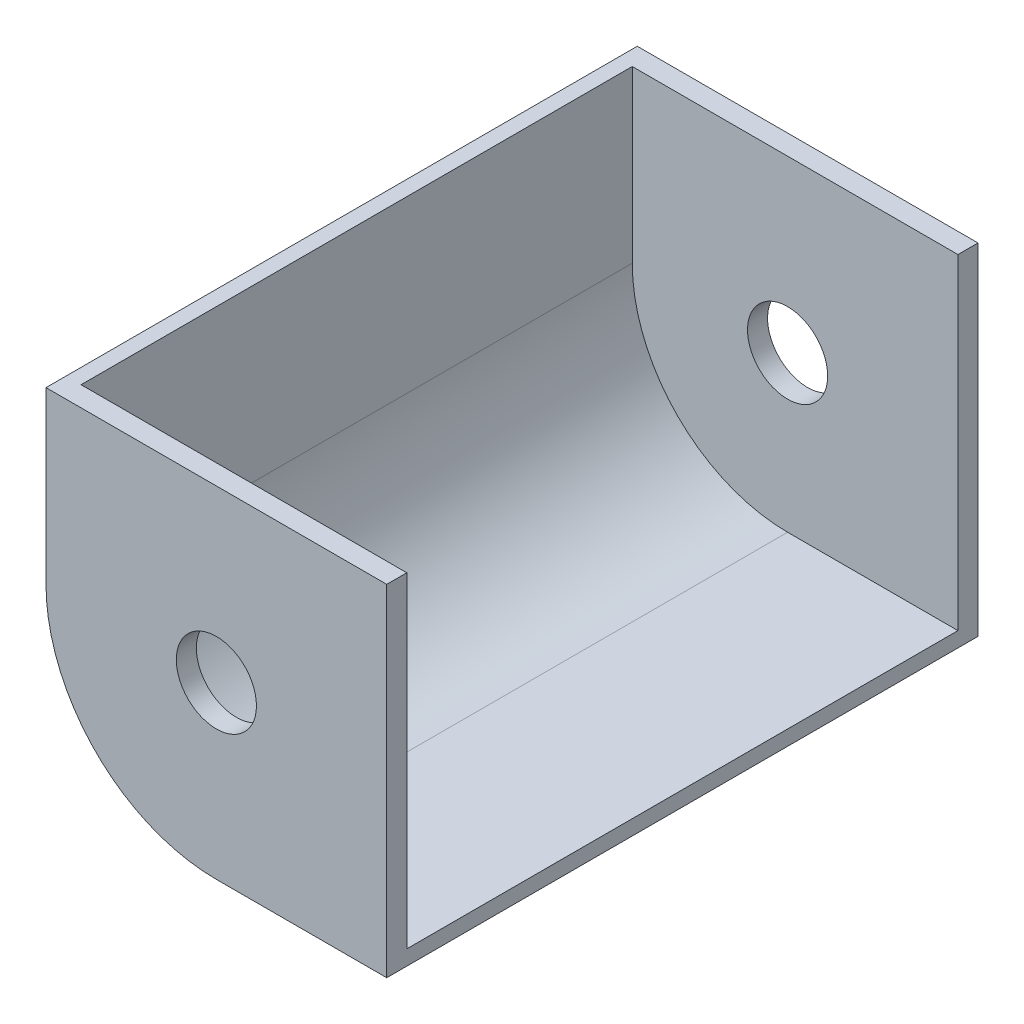
ISO-10303-21;
HEADER;
FILE_DESCRIPTION(('STEP AP214'),'2;1');
FILE_NAME('part.step','',(''),(''),'','','');
FILE_SCHEMA(('AUTOMOTIVE_DESIGN { 1 0 10303 214 1 1 1 1 }'));
ENDSEC;
DATA;
#1=APPLICATION_CONTEXT('core data for automotive mechanical design processes');
#2=APPLICATION_PROTOCOL_DEFINITION('international standard','automotive_design',2000,#1);
#3=PRODUCT_CONTEXT('',#1,'mechanical');
#4=PRODUCT('Part','Part','',(#3));
#5=PRODUCT_RELATED_PRODUCT_CATEGORY('part','',(#4));
#6=PRODUCT_DEFINITION_FORMATION('','',#4);
#7=PRODUCT_DEFINITION_CONTEXT('part definition',#1,'design');
#8=PRODUCT_DEFINITION('design','',#6,#7);
#9=PRODUCT_DEFINITION_SHAPE('','',#8);
#10=(LENGTH_UNIT() NAMED_UNIT(*) SI_UNIT(.MILLI.,.METRE.));
#11=(NAMED_UNIT(*) PLANE_ANGLE_UNIT() SI_UNIT($,.RADIAN.));
#12=(NAMED_UNIT(*) SI_UNIT($,.STERADIAN.) SOLID_ANGLE_UNIT());
#13=UNCERTAINTY_MEASURE_WITH_UNIT(LENGTH_MEASURE(1.E-05),#10,'distance_accuracy_value','');
#14=(GEOMETRIC_REPRESENTATION_CONTEXT(3) GLOBAL_UNCERTAINTY_ASSIGNED_CONTEXT((#13)) GLOBAL_UNIT_ASSIGNED_CONTEXT((#10,
#11,#12)) REPRESENTATION_CONTEXT('',''));
#15=CARTESIAN_POINT('',(0.,0.,0.));
#16=DIRECTION('',(0.,0.,1.));
#17=DIRECTION('',(1.,0.,0.));
#18=AXIS2_PLACEMENT_3D('',#15,#16,#17);
#19=CARTESIAN_POINT('',(-17.,17.,2.));
#20=DIRECTION('',(0.,0.,-1.));
#21=DIRECTION('',(-1.,0.,0.));
#22=AXIS2_PLACEMENT_3D('',#19,#20,#21);
#23=CYLINDRICAL_SURFACE('',#22,17.);
#24=CARTESIAN_POINT('',(-17.,17.,0.));
#25=DIRECTION('',(0.,0.,1.));
#26=DIRECTION('',(1.,0.,0.));
#27=AXIS2_PLACEMENT_3D('',#24,#25,#26);
#28=CIRCLE('',#27,17.);
#29=CARTESIAN_POINT('',(-34.,17.,0.));
#30=VERTEX_POINT('',#29);
#31=CARTESIAN_POINT('',(-17.,0.,0.));
#32=VERTEX_POINT('',#31);
#33=EDGE_CURVE('E177',#30,#32,#28,.T.);
#34=ORIENTED_EDGE('',*,*,#33,.T.);
#35=DIRECTION('',(0.,0.,-1.));
#36=VECTOR('',#35,1.);
#37=CARTESIAN_POINT('',(-17.,0.,2.));
#38=LINE('',#37,#36);
#39=CARTESIAN_POINT('',(-17.,0.,59.));
#40=VERTEX_POINT('',#39);
#41=EDGE_CURVE('E11',#40,#32,#38,.T.);
#42=ORIENTED_EDGE('',*,*,#41,.F.);
#43=CARTESIAN_POINT('',(-17.,17.,59.));
#44=DIRECTION('',(0.,0.,1.));
#45=DIRECTION('',(1.,0.,0.));
#46=AXIS2_PLACEMENT_3D('',#43,#44,#45);
#47=CIRCLE('',#46,17.);
#48=CARTESIAN_POINT('',(-34.,17.,59.));
#49=VERTEX_POINT('',#48);
#50=EDGE_CURVE('E134',#49,#40,#47,.T.);
#51=ORIENTED_EDGE('',*,*,#50,.F.);
#52=DIRECTION('',(0.,0.,-1.));
#53=VECTOR('',#52,1.);
#54=CARTESIAN_POINT('',(-34.,17.,2.));
#55=LINE('',#54,#53);
#56=EDGE_CURVE('E182',#49,#30,#55,.T.);
#57=ORIENTED_EDGE('',*,*,#56,.T.);
#58=EDGE_LOOP('',(#34,#42,#51,#57));
#59=FACE_BOUND('',#58,.T.);
#60=ADVANCED_FACE('F37',(#59),#23,.T.);
#61=CARTESIAN_POINT('',(-17.,0.,2.));
#62=DIRECTION('',(0.,1.,0.));
#63=DIRECTION('',(0.,0.,1.));
#64=AXIS2_PLACEMENT_3D('',#61,#62,#63);
#65=PLANE('',#64);
#66=DIRECTION('',(1.,0.,0.));
#67=VECTOR('',#66,1.);
#68=CARTESIAN_POINT('',(-17.,0.,0.));
#69=LINE('',#68,#67);
#70=CARTESIAN_POINT('',(0.,0.,0.));
#71=VERTEX_POINT('',#70);
#72=EDGE_CURVE('E116',#32,#71,#69,.T.);
#73=ORIENTED_EDGE('',*,*,#72,.T.);
#74=DIRECTION('',(0.,0.,-1.));
#75=VECTOR('',#74,1.);
#76=CARTESIAN_POINT('',(0.,0.,2.));
#77=LINE('',#76,#75);
#78=CARTESIAN_POINT('',(0.,0.,59.));
#79=VERTEX_POINT('',#78);
#80=EDGE_CURVE('E44',#79,#71,#77,.T.);
#81=ORIENTED_EDGE('',*,*,#80,.F.);
#82=DIRECTION('',(1.,0.,0.));
#83=VECTOR('',#82,1.);
#84=CARTESIAN_POINT('',(-17.,0.,59.));
#85=LINE('',#84,#83);
#86=EDGE_CURVE('E115',#40,#79,#85,.T.);
#87=ORIENTED_EDGE('',*,*,#86,.F.);
#88=ORIENTED_EDGE('',*,*,#41,.T.);
#89=EDGE_LOOP('',(#73,#81,#87,#88));
#90=FACE_BOUND('',#89,.T.);
#91=ADVANCED_FACE('F113',(#90),#65,.F.);
#92=CARTESIAN_POINT('',(0.,17.,2.));
#93=DIRECTION('',(-1.,0.,0.));
#94=DIRECTION('',(0.,-1.,0.));
#95=AXIS2_PLACEMENT_3D('',#92,#93,#94);
#96=PLANE('',#95);
#97=DIRECTION('',(0.,1.,0.));
#98=VECTOR('',#97,1.);
#99=CARTESIAN_POINT('',(0.,17.,0.));
#100=LINE('',#99,#98);
#101=CARTESIAN_POINT('',(0.,34.,0.));
#102=VERTEX_POINT('',#101);
#103=EDGE_CURVE('E186',#71,#102,#100,.T.);
#104=ORIENTED_EDGE('',*,*,#103,.T.);
#105=DIRECTION('',(0.,0.,-1.));
#106=VECTOR('',#105,1.);
#107=CARTESIAN_POINT('',(0.,34.,2.));
#108=LINE('',#107,#106);
#109=CARTESIAN_POINT('',(0.,34.,2.));
#110=VERTEX_POINT('',#109);
#111=EDGE_CURVE('E119',#110,#102,#108,.T.);
#112=ORIENTED_EDGE('',*,*,#111,.F.);
#113=DIRECTION('',(0.,1.,0.));
#114=VECTOR('',#113,1.);
#115=CARTESIAN_POINT('',(0.,17.,2.));
#116=LINE('',#115,#114);
#117=CARTESIAN_POINT('',(0.,1.5,2.));
#118=VERTEX_POINT('',#117);
#119=EDGE_CURVE('E178',#118,#110,#116,.T.);
#120=ORIENTED_EDGE('',*,*,#119,.F.);
#121=DIRECTION('',(0.,0.,-1.));
#122=VECTOR('',#121,1.);
#123=CARTESIAN_POINT('',(0.,1.5,57.));
#124=LINE('',#123,#122);
#125=CARTESIAN_POINT('',(0.,1.5,57.));
#126=VERTEX_POINT('',#125);
#127=EDGE_CURVE('E174',#126,#118,#124,.T.);
#128=ORIENTED_EDGE('',*,*,#127,.F.);
#129=DIRECTION('',(0.,1.,0.));
#130=VECTOR('',#129,1.);
#131=CARTESIAN_POINT('',(0.,1.5,57.));
#132=LINE('',#131,#130);
#133=CARTESIAN_POINT('',(0.,34.,57.));
#134=VERTEX_POINT('',#133);
#135=EDGE_CURVE('E138',#126,#134,#132,.T.);
#136=ORIENTED_EDGE('',*,*,#135,.T.);
#137=DIRECTION('',(0.,0.,-1.));
#138=VECTOR('',#137,1.);
#139=CARTESIAN_POINT('',(0.,34.,59.));
#140=LINE('',#139,#138);
#141=CARTESIAN_POINT('',(0.,34.,59.));
#142=VERTEX_POINT('',#141);
#143=EDGE_CURVE('E124',#142,#134,#140,.T.);
#144=ORIENTED_EDGE('',*,*,#143,.F.);
#145=DIRECTION('',(0.,1.,0.));
#146=VECTOR('',#145,1.);
#147=CARTESIAN_POINT('',(0.,0.,59.));
#148=LINE('',#147,#146);
#149=EDGE_CURVE('E121',#79,#142,#148,.T.);
#150=ORIENTED_EDGE('',*,*,#149,.F.);
#151=ORIENTED_EDGE('',*,*,#80,.T.);
#152=EDGE_LOOP('',(#104,#112,#120,#128,#136,#144,#150,#151));
#153=FACE_BOUND('',#152,.T.);
#154=ADVANCED_FACE('F122',(#153),#96,.F.);
#155=CARTESIAN_POINT('',(-34.,34.,2.));
#156=DIRECTION('',(0.,-1.,0.));
#157=DIRECTION('',(0.,0.,-1.));
#158=AXIS2_PLACEMENT_3D('',#155,#156,#157);
#159=PLANE('',#158);
#160=DIRECTION('',(-1.,0.,0.));
#161=VECTOR('',#160,1.);
#162=CARTESIAN_POINT('',(-34.,34.,0.));
#163=LINE('',#162,#161);
#164=CARTESIAN_POINT('',(-34.,34.,0.));
#165=VERTEX_POINT('',#164);
#166=EDGE_CURVE('E188',#102,#165,#163,.T.);
#167=ORIENTED_EDGE('',*,*,#166,.T.);
#168=DIRECTION('',(0.,0.,-1.));
#169=VECTOR('',#168,1.);
#170=CARTESIAN_POINT('',(-34.,34.,2.));
#171=LINE('',#170,#169);
#172=CARTESIAN_POINT('',(-34.,34.,59.));
#173=VERTEX_POINT('',#172);
#174=EDGE_CURVE('E193',#173,#165,#171,.T.);
#175=ORIENTED_EDGE('',*,*,#174,.F.);
#176=DIRECTION('',(-1.,0.,0.));
#177=VECTOR('',#176,1.);
#178=CARTESIAN_POINT('',(0.,34.,59.));
#179=LINE('',#178,#177);
#180=EDGE_CURVE('E128',#142,#173,#179,.T.);
#181=ORIENTED_EDGE('',*,*,#180,.F.);
#182=ORIENTED_EDGE('',*,*,#143,.T.);
#183=DIRECTION('',(-1.,0.,0.));
#184=VECTOR('',#183,1.);
#185=CARTESIAN_POINT('',(-32.5,34.,57.));
#186=LINE('',#185,#184);
#187=CARTESIAN_POINT('',(-32.5,34.,57.));
#188=VERTEX_POINT('',#187);
#189=EDGE_CURVE('E135',#134,#188,#186,.T.);
#190=ORIENTED_EDGE('',*,*,#189,.T.);
#191=DIRECTION('',(0.,0.,-1.));
#192=VECTOR('',#191,1.);
#193=CARTESIAN_POINT('',(-32.5,34.,57.));
#194=LINE('',#193,#192);
#195=CARTESIAN_POINT('',(-32.5,34.,2.));
#196=VERTEX_POINT('',#195);
#197=EDGE_CURVE('E160',#188,#196,#194,.T.);
#198=ORIENTED_EDGE('',*,*,#197,.T.);
#199=DIRECTION('',(-1.,0.,0.));
#200=VECTOR('',#199,1.);
#201=CARTESIAN_POINT('',(0.,34.,2.));
#202=LINE('',#201,#200);
#203=EDGE_CURVE('E56',#110,#196,#202,.T.);
#204=ORIENTED_EDGE('',*,*,#203,.F.);
#205=ORIENTED_EDGE('',*,*,#111,.T.);
#206=EDGE_LOOP('',(#167,#175,#181,#182,#190,#198,#204,#205));
#207=FACE_BOUND('',#206,.T.);
#208=ADVANCED_FACE('F199',(#207),#159,.F.);
#209=CARTESIAN_POINT('',(-34.,17.,2.));
#210=DIRECTION('',(1.,0.,0.));
#211=DIRECTION('',(0.,1.,0.));
#212=AXIS2_PLACEMENT_3D('',#209,#210,#211);
#213=PLANE('',#212);
#214=DIRECTION('',(0.,-1.,0.));
#215=VECTOR('',#214,1.);
#216=CARTESIAN_POINT('',(-34.,17.,0.));
#217=LINE('',#216,#215);
#218=EDGE_CURVE('E180',#165,#30,#217,.T.);
#219=ORIENTED_EDGE('',*,*,#218,.T.);
#220=ORIENTED_EDGE('',*,*,#56,.F.);
#221=DIRECTION('',(0.,-1.,0.));
#222=VECTOR('',#221,1.);
#223=CARTESIAN_POINT('',(-34.,34.,59.));
#224=LINE('',#223,#222);
#225=EDGE_CURVE('E145',#173,#49,#224,.T.);
#226=ORIENTED_EDGE('',*,*,#225,.F.);
#227=ORIENTED_EDGE('',*,*,#174,.T.);
#228=EDGE_LOOP('',(#219,#220,#226,#227));
#229=FACE_BOUND('',#228,.T.);
#230=ADVANCED_FACE('F206',(#229),#213,.F.);
#231=CARTESIAN_POINT('',(-17.,17.,2.));
#232=DIRECTION('',(0.,0.,1.));
#233=DIRECTION('',(1.,0.,0.));
#234=AXIS2_PLACEMENT_3D('',#231,#232,#233);
#235=PLANE('',#234);
#236=CARTESIAN_POINT('',(-17.,17.,2.));
#237=DIRECTION('',(0.,0.,1.));
#238=DIRECTION('',(1.,0.,0.));
#239=AXIS2_PLACEMENT_3D('',#236,#237,#238);
#240=CIRCLE('',#239,4.);
#241=CARTESIAN_POINT('',(-13.,17.,2.));
#242=VERTEX_POINT('',#241);
#243=EDGE_CURVE('E141',#242,#242,#240,.T.);
#244=ORIENTED_EDGE('',*,*,#243,.F.);
#245=EDGE_LOOP('',(#244));
#246=FACE_BOUND('',#245,.T.);
#247=DIRECTION('',(0.,1.,0.));
#248=VECTOR('',#247,1.);
#249=CARTESIAN_POINT('',(-32.5,34.,2.));
#250=LINE('',#249,#248);
#251=CARTESIAN_POINT('',(-32.5,17.,2.));
#252=VERTEX_POINT('',#251);
#253=EDGE_CURVE('E51',#252,#196,#250,.T.);
#254=ORIENTED_EDGE('',*,*,#253,.F.);
#255=CARTESIAN_POINT('',(-17.,17.,2.));
#256=DIRECTION('',(0.,0.,-1.));
#257=DIRECTION('',(1.,0.,0.));
#258=AXIS2_PLACEMENT_3D('',#255,#256,#257);
#259=CIRCLE('',#258,15.5);
#260=CARTESIAN_POINT('',(-17.,1.5,2.));
#261=VERTEX_POINT('',#260);
#262=EDGE_CURVE('E163',#261,#252,#259,.T.);
#263=ORIENTED_EDGE('',*,*,#262,.F.);
#264=DIRECTION('',(-1.,0.,0.));
#265=VECTOR('',#264,1.);
#266=CARTESIAN_POINT('',(-17.,1.5,2.));
#267=LINE('',#266,#265);
#268=EDGE_CURVE('E150',#118,#261,#267,.T.);
#269=ORIENTED_EDGE('',*,*,#268,.F.);
#270=ORIENTED_EDGE('',*,*,#119,.T.);
#271=ORIENTED_EDGE('',*,*,#203,.T.);
#272=EDGE_LOOP('',(#254,#263,#269,#270,#271));
#273=FACE_BOUND('',#272,.T.);
#274=ADVANCED_FACE('F222',(#246,#273),#235,.T.);
#275=CARTESIAN_POINT('',(-17.,17.,0.));
#276=DIRECTION('',(0.,0.,1.));
#277=DIRECTION('',(1.,0.,0.));
#278=AXIS2_PLACEMENT_3D('',#275,#276,#277);
#279=PLANE('',#278);
#280=CARTESIAN_POINT('',(-17.,17.,0.));
#281=DIRECTION('',(0.,0.,1.));
#282=DIRECTION('',(1.,0.,0.));
#283=AXIS2_PLACEMENT_3D('',#280,#281,#282);
#284=CIRCLE('',#283,4.);
#285=CARTESIAN_POINT('',(-13.,17.,0.));
#286=VERTEX_POINT('',#285);
#287=EDGE_CURVE('E261',#286,#286,#284,.T.);
#288=ORIENTED_EDGE('',*,*,#287,.T.);
#289=EDGE_LOOP('',(#288));
#290=FACE_BOUND('',#289,.T.);
#291=ORIENTED_EDGE('',*,*,#33,.F.);
#292=ORIENTED_EDGE('',*,*,#218,.F.);
#293=ORIENTED_EDGE('',*,*,#166,.F.);
#294=ORIENTED_EDGE('',*,*,#103,.F.);
#295=ORIENTED_EDGE('',*,*,#72,.F.);
#296=EDGE_LOOP('',(#291,#292,#293,#294,#295));
#297=FACE_BOUND('',#296,.T.);
#298=ADVANCED_FACE('F203',(#290,#297),#279,.F.);
#299=CARTESIAN_POINT('',(-17.,1.5,57.));
#300=DIRECTION('',(0.,-1.,0.));
#301=DIRECTION('',(1.,0.,0.));
#302=AXIS2_PLACEMENT_3D('',#299,#300,#301);
#303=PLANE('',#302);
#304=ORIENTED_EDGE('',*,*,#268,.T.);
#305=DIRECTION('',(0.,0.,-1.));
#306=VECTOR('',#305,1.);
#307=CARTESIAN_POINT('',(-17.,1.5,57.));
#308=LINE('',#307,#306);
#309=CARTESIAN_POINT('',(-17.,1.5,57.));
#310=VERTEX_POINT('',#309);
#311=EDGE_CURVE('E171',#310,#261,#308,.T.);
#312=ORIENTED_EDGE('',*,*,#311,.F.);
#313=DIRECTION('',(-1.,0.,0.));
#314=VECTOR('',#313,1.);
#315=CARTESIAN_POINT('',(-17.,1.5,57.));
#316=LINE('',#315,#314);
#317=EDGE_CURVE('E151',#126,#310,#316,.T.);
#318=ORIENTED_EDGE('',*,*,#317,.F.);
#319=ORIENTED_EDGE('',*,*,#127,.T.);
#320=EDGE_LOOP('',(#304,#312,#318,#319));
#321=FACE_BOUND('',#320,.T.);
#322=ADVANCED_FACE('F225',(#321),#303,.F.);
#323=CARTESIAN_POINT('',(-17.,17.,57.));
#324=DIRECTION('',(0.,0.,-1.));
#325=DIRECTION('',(-1.,0.,0.));
#326=AXIS2_PLACEMENT_3D('',#323,#324,#325);
#327=CYLINDRICAL_SURFACE('',#326,15.5);
#328=ORIENTED_EDGE('',*,*,#262,.T.);
#329=DIRECTION('',(0.,0.,-1.));
#330=VECTOR('',#329,1.);
#331=CARTESIAN_POINT('',(-32.5,17.,57.));
#332=LINE('',#331,#330);
#333=CARTESIAN_POINT('',(-32.5,17.,57.));
#334=VERTEX_POINT('',#333);
#335=EDGE_CURVE('E168',#334,#252,#332,.T.);
#336=ORIENTED_EDGE('',*,*,#335,.F.);
#337=CARTESIAN_POINT('',(-17.,17.,57.));
#338=DIRECTION('',(0.,0.,-1.));
#339=DIRECTION('',(1.,0.,0.));
#340=AXIS2_PLACEMENT_3D('',#337,#338,#339);
#341=CIRCLE('',#340,15.5);
#342=EDGE_CURVE('E154',#310,#334,#341,.T.);
#343=ORIENTED_EDGE('',*,*,#342,.F.);
#344=ORIENTED_EDGE('',*,*,#311,.T.);
#345=EDGE_LOOP('',(#328,#336,#343,#344));
#346=FACE_BOUND('',#345,.T.);
#347=ADVANCED_FACE('F232',(#346),#327,.F.);
#348=CARTESIAN_POINT('',(-32.5,34.,57.));
#349=DIRECTION('',(-1.,0.,0.));
#350=DIRECTION('',(0.,0.,1.));
#351=AXIS2_PLACEMENT_3D('',#348,#349,#350);
#352=PLANE('',#351);
#353=ORIENTED_EDGE('',*,*,#253,.T.);
#354=ORIENTED_EDGE('',*,*,#197,.F.);
#355=DIRECTION('',(0.,1.,0.));
#356=VECTOR('',#355,1.);
#357=CARTESIAN_POINT('',(-32.5,34.,57.));
#358=LINE('',#357,#356);
#359=EDGE_CURVE('E157',#334,#188,#358,.T.);
#360=ORIENTED_EDGE('',*,*,#359,.F.);
#361=ORIENTED_EDGE('',*,*,#335,.T.);
#362=EDGE_LOOP('',(#353,#354,#360,#361));
#363=FACE_BOUND('',#362,.T.);
#364=ADVANCED_FACE('F236',(#363),#352,.F.);
#365=CARTESIAN_POINT('',(-17.,17.,57.));
#366=DIRECTION('',(0.,0.,1.));
#367=DIRECTION('',(1.,0.,0.));
#368=AXIS2_PLACEMENT_3D('',#365,#366,#367);
#369=PLANE('',#368);
#370=CARTESIAN_POINT('',(-17.,17.,57.));
#371=DIRECTION('',(0.,0.,1.));
#372=DIRECTION('',(1.,0.,0.));
#373=AXIS2_PLACEMENT_3D('',#370,#371,#372);
#374=CIRCLE('',#373,4.);
#375=CARTESIAN_POINT('',(-13.,17.,57.));
#376=VERTEX_POINT('',#375);
#377=EDGE_CURVE('E262',#376,#376,#374,.T.);
#378=ORIENTED_EDGE('',*,*,#377,.T.);
#379=EDGE_LOOP('',(#378));
#380=FACE_BOUND('',#379,.T.);
#381=ORIENTED_EDGE('',*,*,#135,.F.);
#382=ORIENTED_EDGE('',*,*,#317,.T.);
#383=ORIENTED_EDGE('',*,*,#342,.T.);
#384=ORIENTED_EDGE('',*,*,#359,.T.);
#385=ORIENTED_EDGE('',*,*,#189,.F.);
#386=EDGE_LOOP('',(#381,#382,#383,#384,#385));
#387=FACE_BOUND('',#386,.T.);
#388=ADVANCED_FACE('F240',(#380,#387),#369,.F.);
#389=CARTESIAN_POINT('',(-17.,17.,59.));
#390=DIRECTION('',(0.,0.,1.));
#391=DIRECTION('',(1.,0.,0.));
#392=AXIS2_PLACEMENT_3D('',#389,#390,#391);
#393=PLANE('',#392);
#394=CARTESIAN_POINT('',(-17.,17.,59.));
#395=DIRECTION('',(0.,0.,1.));
#396=DIRECTION('',(1.,0.,0.));
#397=AXIS2_PLACEMENT_3D('',#394,#395,#396);
#398=CIRCLE('',#397,4.);
#399=CARTESIAN_POINT('',(-13.,17.,59.));
#400=VERTEX_POINT('',#399);
#401=EDGE_CURVE('E263',#400,#400,#398,.T.);
#402=ORIENTED_EDGE('',*,*,#401,.F.);
#403=EDGE_LOOP('',(#402));
#404=FACE_BOUND('',#403,.T.);
#405=ORIENTED_EDGE('',*,*,#86,.T.);
#406=ORIENTED_EDGE('',*,*,#149,.T.);
#407=ORIENTED_EDGE('',*,*,#180,.T.);
#408=ORIENTED_EDGE('',*,*,#225,.T.);
#409=ORIENTED_EDGE('',*,*,#50,.T.);
#410=EDGE_LOOP('',(#405,#406,#407,#408,#409));
#411=FACE_BOUND('',#410,.T.);
#412=ADVANCED_FACE('F131',(#404,#411),#393,.T.);
#413=CARTESIAN_POINT('',(-17.,17.,0.));
#414=DIRECTION('',(0.,0.,1.));
#415=DIRECTION('',(1.,0.,0.));
#416=AXIS2_PLACEMENT_3D('',#413,#414,#415);
#417=CYLINDRICAL_SURFACE('',#416,4.);
#418=ORIENTED_EDGE('',*,*,#401,.T.);
#419=EDGE_LOOP('',(#418));
#420=FACE_BOUND('',#419,.T.);
#421=ORIENTED_EDGE('',*,*,#377,.F.);
#422=EDGE_LOOP('',(#421));
#423=FACE_BOUND('',#422,.T.);
#424=ADVANCED_FACE('F247',(#420,#423),#417,.F.);
#425=ORIENTED_EDGE('',*,*,#243,.T.);
#426=EDGE_LOOP('',(#425));
#427=FACE_BOUND('',#426,.T.);
#428=ORIENTED_EDGE('',*,*,#287,.F.);
#429=EDGE_LOOP('',(#428));
#430=FACE_BOUND('',#429,.T.);
#431=ADVANCED_FACE('F249',(#427,#430),#417,.F.);
#432=CLOSED_SHELL('',(#60,#91,#154,#208,#230,#274,#298,#322,#347,#364,#388,#412,#424,#431));
#433=MANIFOLD_SOLID_BREP('B2',#432);
#434=ADVANCED_BREP_SHAPE_REPRESENTATION('',(#18,#433),#14);
#435=SHAPE_DEFINITION_REPRESENTATION(#9,#434);
ENDSEC;
END-ISO-10303-21;
